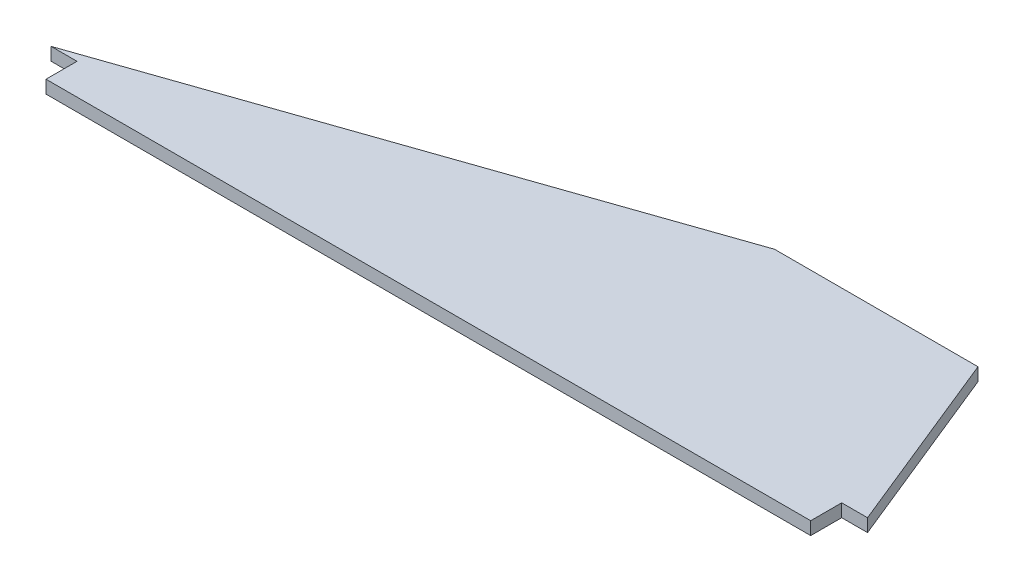
ISO-10303-21;
HEADER;
FILE_DESCRIPTION(('STEP AP214'),'2;1');
FILE_NAME('part.step','',(''),(''),'','','');
FILE_SCHEMA(('AUTOMOTIVE_DESIGN { 1 0 10303 214 1 1 1 1 }'));
ENDSEC;
DATA;
#1=APPLICATION_CONTEXT('core data for automotive mechanical design processes');
#2=APPLICATION_PROTOCOL_DEFINITION('international standard','automotive_design',2000,#1);
#3=PRODUCT_CONTEXT('',#1,'mechanical');
#4=PRODUCT('Part','Part','',(#3));
#5=PRODUCT_RELATED_PRODUCT_CATEGORY('part','',(#4));
#6=PRODUCT_DEFINITION_FORMATION('','',#4);
#7=PRODUCT_DEFINITION_CONTEXT('part definition',#1,'design');
#8=PRODUCT_DEFINITION('design','',#6,#7);
#9=PRODUCT_DEFINITION_SHAPE('','',#8);
#10=(LENGTH_UNIT() NAMED_UNIT(*) SI_UNIT(.MILLI.,.METRE.));
#11=(NAMED_UNIT(*) PLANE_ANGLE_UNIT() SI_UNIT($,.RADIAN.));
#12=(NAMED_UNIT(*) SI_UNIT($,.STERADIAN.) SOLID_ANGLE_UNIT());
#13=UNCERTAINTY_MEASURE_WITH_UNIT(LENGTH_MEASURE(1.E-05),#10,'distance_accuracy_value','');
#14=(GEOMETRIC_REPRESENTATION_CONTEXT(3) GLOBAL_UNCERTAINTY_ASSIGNED_CONTEXT((#13)) GLOBAL_UNIT_ASSIGNED_CONTEXT((#10,
#11,#12)) REPRESENTATION_CONTEXT('',''));
#15=CARTESIAN_POINT('',(0.,0.,0.));
#16=DIRECTION('',(0.,0.,1.));
#17=DIRECTION('',(1.,0.,0.));
#18=AXIS2_PLACEMENT_3D('',#15,#16,#17);
#19=CARTESIAN_POINT('',(6.35,3.175,0.));
#20=DIRECTION('',(1.,0.,0.));
#21=DIRECTION('',(0.,0.,-1.));
#22=AXIS2_PLACEMENT_3D('',#19,#20,#21);
#23=PLANE('',#22);
#24=DIRECTION('',(0.,0.,1.));
#25=VECTOR('',#24,1.);
#26=CARTESIAN_POINT('',(6.35,0.,0.));
#27=LINE('',#26,#25);
#28=CARTESIAN_POINT('',(6.35,0.,0.));
#29=VERTEX_POINT('',#28);
#30=CARTESIAN_POINT('',(6.35,0.,7.62));
#31=VERTEX_POINT('',#30);
#32=EDGE_CURVE('E134',#29,#31,#27,.T.);
#33=ORIENTED_EDGE('',*,*,#32,.T.);
#34=DIRECTION('',(0.,-1.,0.));
#35=VECTOR('',#34,1.);
#36=CARTESIAN_POINT('',(6.35,3.175,7.62));
#37=LINE('',#36,#35);
#38=CARTESIAN_POINT('',(6.35,3.175,7.62));
#39=VERTEX_POINT('',#38);
#40=EDGE_CURVE('E11',#39,#31,#37,.T.);
#41=ORIENTED_EDGE('',*,*,#40,.F.);
#42=DIRECTION('',(0.,0.,1.));
#43=VECTOR('',#42,1.);
#44=CARTESIAN_POINT('',(6.35,3.175,0.));
#45=LINE('',#44,#43);
#46=CARTESIAN_POINT('',(6.35,3.175,0.));
#47=VERTEX_POINT('',#46);
#48=EDGE_CURVE('E148',#47,#39,#45,.T.);
#49=ORIENTED_EDGE('',*,*,#48,.F.);
#50=DIRECTION('',(0.,-1.,0.));
#51=VECTOR('',#50,1.);
#52=CARTESIAN_POINT('',(6.35,3.175,0.));
#53=LINE('',#52,#51);
#54=EDGE_CURVE('E130',#47,#29,#53,.T.);
#55=ORIENTED_EDGE('',*,*,#54,.T.);
#56=EDGE_LOOP('',(#33,#41,#49,#55));
#57=FACE_BOUND('',#56,.T.);
#58=ADVANCED_FACE('F38',(#57),#23,.F.);
#59=CARTESIAN_POINT('',(6.35,3.175,7.62));
#60=DIRECTION('',(0.,0.,-1.));
#61=DIRECTION('',(-1.,0.,0.));
#62=AXIS2_PLACEMENT_3D('',#59,#60,#61);
#63=PLANE('',#62);
#64=DIRECTION('',(1.,0.,0.));
#65=VECTOR('',#64,1.);
#66=CARTESIAN_POINT('',(6.35,0.,7.62));
#67=LINE('',#66,#65);
#68=CARTESIAN_POINT('',(194.31,0.,7.62));
#69=VERTEX_POINT('',#68);
#70=EDGE_CURVE('E137',#31,#69,#67,.T.);
#71=ORIENTED_EDGE('',*,*,#70,.T.);
#72=DIRECTION('',(0.,-1.,0.));
#73=VECTOR('',#72,1.);
#74=CARTESIAN_POINT('',(194.31,3.175,7.62));
#75=LINE('',#74,#73);
#76=CARTESIAN_POINT('',(194.31,3.175,7.62));
#77=VERTEX_POINT('',#76);
#78=EDGE_CURVE('E46',#77,#69,#75,.T.);
#79=ORIENTED_EDGE('',*,*,#78,.F.);
#80=DIRECTION('',(1.,0.,0.));
#81=VECTOR('',#80,1.);
#82=CARTESIAN_POINT('',(6.35,3.175,7.62));
#83=LINE('',#82,#81);
#84=EDGE_CURVE('E97',#39,#77,#83,.T.);
#85=ORIENTED_EDGE('',*,*,#84,.F.);
#86=ORIENTED_EDGE('',*,*,#40,.T.);
#87=EDGE_LOOP('',(#71,#79,#85,#86));
#88=FACE_BOUND('',#87,.T.);
#89=ADVANCED_FACE('F183',(#88),#63,.F.);
#90=CARTESIAN_POINT('',(194.31,3.175,0.));
#91=DIRECTION('',(-1.,0.,0.));
#92=DIRECTION('',(0.,0.,1.));
#93=AXIS2_PLACEMENT_3D('',#90,#91,#92);
#94=PLANE('',#93);
#95=DIRECTION('',(0.,0.,-1.));
#96=VECTOR('',#95,1.);
#97=CARTESIAN_POINT('',(194.31,0.,0.));
#98=LINE('',#97,#96);
#99=CARTESIAN_POINT('',(194.31,0.,0.));
#100=VERTEX_POINT('',#99);
#101=EDGE_CURVE('E139',#69,#100,#98,.T.);
#102=ORIENTED_EDGE('',*,*,#101,.T.);
#103=DIRECTION('',(0.,-1.,0.));
#104=VECTOR('',#103,1.);
#105=CARTESIAN_POINT('',(194.31,3.175,0.));
#106=LINE('',#105,#104);
#107=CARTESIAN_POINT('',(194.31,3.175,0.));
#108=VERTEX_POINT('',#107);
#109=EDGE_CURVE('E155',#108,#100,#106,.T.);
#110=ORIENTED_EDGE('',*,*,#109,.F.);
#111=DIRECTION('',(0.,0.,-1.));
#112=VECTOR('',#111,1.);
#113=CARTESIAN_POINT('',(194.31,3.175,0.));
#114=LINE('',#113,#112);
#115=EDGE_CURVE('E163',#77,#108,#114,.T.);
#116=ORIENTED_EDGE('',*,*,#115,.F.);
#117=ORIENTED_EDGE('',*,*,#78,.T.);
#118=EDGE_LOOP('',(#102,#110,#116,#117));
#119=FACE_BOUND('',#118,.T.);
#120=ADVANCED_FACE('F161',(#119),#94,.F.);
#121=CARTESIAN_POINT('',(194.31,3.175,0.));
#122=DIRECTION('',(0.,0.,-1.));
#123=DIRECTION('',(-1.,0.,0.));
#124=AXIS2_PLACEMENT_3D('',#121,#122,#123);
#125=PLANE('',#124);
#126=DIRECTION('',(1.,0.,0.));
#127=VECTOR('',#126,1.);
#128=CARTESIAN_POINT('',(194.31,0.,0.));
#129=LINE('',#128,#127);
#130=CARTESIAN_POINT('',(200.66,0.,0.));
#131=VERTEX_POINT('',#130);
#132=EDGE_CURVE('E141',#100,#131,#129,.T.);
#133=ORIENTED_EDGE('',*,*,#132,.T.);
#134=DIRECTION('',(0.,-1.,0.));
#135=VECTOR('',#134,1.);
#136=CARTESIAN_POINT('',(200.66,3.175,0.));
#137=LINE('',#136,#135);
#138=CARTESIAN_POINT('',(200.66,3.175,0.));
#139=VERTEX_POINT('',#138);
#140=EDGE_CURVE('E152',#139,#131,#137,.T.);
#141=ORIENTED_EDGE('',*,*,#140,.F.);
#142=DIRECTION('',(1.,0.,0.));
#143=VECTOR('',#142,1.);
#144=CARTESIAN_POINT('',(194.31,3.175,0.));
#145=LINE('',#144,#143);
#146=EDGE_CURVE('E175',#108,#139,#145,.T.);
#147=ORIENTED_EDGE('',*,*,#146,.F.);
#148=ORIENTED_EDGE('',*,*,#109,.T.);
#149=EDGE_LOOP('',(#133,#141,#147,#148));
#150=FACE_BOUND('',#149,.T.);
#151=ADVANCED_FACE('F171',(#150),#125,.F.);
#152=CARTESIAN_POINT('',(182.0926,3.175,-45.72));
#153=DIRECTION('',(-0.926511442099165,0.,0.37626659120805));
#154=DIRECTION('',(0.37626659120805,0.,0.926511442099165));
#155=AXIS2_PLACEMENT_3D('',#152,#153,#154);
#156=PLANE('',#155);
#157=DIRECTION('',(-0.37626659120805,0.,-0.926511442099165));
#158=VECTOR('',#157,1.);
#159=CARTESIAN_POINT('',(182.0926,0.,-45.72));
#160=LINE('',#159,#158);
#161=CARTESIAN_POINT('',(182.0926,0.,-45.72));
#162=VERTEX_POINT('',#161);
#163=EDGE_CURVE('E143',#131,#162,#160,.T.);
#164=ORIENTED_EDGE('',*,*,#163,.T.);
#165=DIRECTION('',(0.,-1.,0.));
#166=VECTOR('',#165,1.);
#167=CARTESIAN_POINT('',(182.0926,3.175,-45.72));
#168=LINE('',#167,#166);
#169=CARTESIAN_POINT('',(182.0926,3.175,-45.72));
#170=VERTEX_POINT('',#169);
#171=EDGE_CURVE('E125',#170,#162,#168,.T.);
#172=ORIENTED_EDGE('',*,*,#171,.F.);
#173=DIRECTION('',(-0.37626659120805,0.,-0.926511442099165));
#174=VECTOR('',#173,1.);
#175=CARTESIAN_POINT('',(182.0926,3.175,-45.72));
#176=LINE('',#175,#174);
#177=EDGE_CURVE('E116',#139,#170,#176,.T.);
#178=ORIENTED_EDGE('',*,*,#177,.F.);
#179=ORIENTED_EDGE('',*,*,#140,.T.);
#180=EDGE_LOOP('',(#164,#172,#178,#179));
#181=FACE_BOUND('',#180,.T.);
#182=ADVANCED_FACE('F174',(#181),#156,.F.);
#183=CARTESIAN_POINT('',(132.08,3.175,-45.72));
#184=DIRECTION('',(0.,0.,1.));
#185=DIRECTION('',(1.,0.,0.));
#186=AXIS2_PLACEMENT_3D('',#183,#184,#185);
#187=PLANE('',#186);
#188=DIRECTION('',(-1.,0.,0.));
#189=VECTOR('',#188,1.);
#190=CARTESIAN_POINT('',(132.08,0.,-45.72));
#191=LINE('',#190,#189);
#192=CARTESIAN_POINT('',(132.08,0.,-45.72));
#193=VERTEX_POINT('',#192);
#194=EDGE_CURVE('E124',#162,#193,#191,.T.);
#195=ORIENTED_EDGE('',*,*,#194,.T.);
#196=DIRECTION('',(0.,-1.,0.));
#197=VECTOR('',#196,1.);
#198=CARTESIAN_POINT('',(132.08,3.175,-45.72));
#199=LINE('',#198,#197);
#200=CARTESIAN_POINT('',(132.08,3.175,-45.72));
#201=VERTEX_POINT('',#200);
#202=EDGE_CURVE('E121',#201,#193,#199,.T.);
#203=ORIENTED_EDGE('',*,*,#202,.F.);
#204=DIRECTION('',(-1.,0.,0.));
#205=VECTOR('',#204,1.);
#206=CARTESIAN_POINT('',(132.08,3.175,-45.72));
#207=LINE('',#206,#205);
#208=EDGE_CURVE('E110',#170,#201,#207,.T.);
#209=ORIENTED_EDGE('',*,*,#208,.F.);
#210=ORIENTED_EDGE('',*,*,#171,.T.);
#211=EDGE_LOOP('',(#195,#203,#209,#210));
#212=FACE_BOUND('',#211,.T.);
#213=ADVANCED_FACE('F122',(#212),#187,.F.);
#214=CARTESIAN_POINT('',(0.,3.175,0.));
#215=DIRECTION('',(0.327110563883166,0.,0.944986073440258));
#216=DIRECTION('',(0.944986073440258,0.,-0.327110563883166));
#217=AXIS2_PLACEMENT_3D('',#214,#215,#216);
#218=PLANE('',#217);
#219=DIRECTION('',(-0.944986073440258,0.,0.327110563883166));
#220=VECTOR('',#219,1.);
#221=CARTESIAN_POINT('',(0.,0.,0.));
#222=LINE('',#221,#220);
#223=CARTESIAN_POINT('',(0.,0.,0.));
#224=VERTEX_POINT('',#223);
#225=EDGE_CURVE('E83',#193,#224,#222,.T.);
#226=ORIENTED_EDGE('',*,*,#225,.T.);
#227=DIRECTION('',(0.,-1.,0.));
#228=VECTOR('',#227,1.);
#229=CARTESIAN_POINT('',(0.,3.175,0.));
#230=LINE('',#229,#228);
#231=CARTESIAN_POINT('',(0.,3.175,0.));
#232=VERTEX_POINT('',#231);
#233=EDGE_CURVE('E126',#232,#224,#230,.T.);
#234=ORIENTED_EDGE('',*,*,#233,.F.);
#235=DIRECTION('',(-0.944986073440258,0.,0.327110563883166));
#236=VECTOR('',#235,1.);
#237=CARTESIAN_POINT('',(0.,3.175,0.));
#238=LINE('',#237,#236);
#239=EDGE_CURVE('E114',#201,#232,#238,.T.);
#240=ORIENTED_EDGE('',*,*,#239,.F.);
#241=ORIENTED_EDGE('',*,*,#202,.T.);
#242=EDGE_LOOP('',(#226,#234,#240,#241));
#243=FACE_BOUND('',#242,.T.);
#244=ADVANCED_FACE('F128',(#243),#218,.F.);
#245=CARTESIAN_POINT('',(0.,3.175,0.));
#246=DIRECTION('',(0.,0.,-1.));
#247=DIRECTION('',(-1.,0.,0.));
#248=AXIS2_PLACEMENT_3D('',#245,#246,#247);
#249=PLANE('',#248);
#250=DIRECTION('',(1.,0.,0.));
#251=VECTOR('',#250,1.);
#252=CARTESIAN_POINT('',(0.,0.,0.));
#253=LINE('',#252,#251);
#254=EDGE_CURVE('E89',#224,#29,#253,.T.);
#255=ORIENTED_EDGE('',*,*,#254,.T.);
#256=ORIENTED_EDGE('',*,*,#54,.F.);
#257=DIRECTION('',(1.,0.,0.));
#258=VECTOR('',#257,1.);
#259=CARTESIAN_POINT('',(0.,3.175,0.));
#260=LINE('',#259,#258);
#261=EDGE_CURVE('E54',#232,#47,#260,.T.);
#262=ORIENTED_EDGE('',*,*,#261,.F.);
#263=ORIENTED_EDGE('',*,*,#233,.T.);
#264=EDGE_LOOP('',(#255,#256,#262,#263));
#265=FACE_BOUND('',#264,.T.);
#266=ADVANCED_FACE('F199',(#265),#249,.F.);
#267=CARTESIAN_POINT('',(0.,3.175,0.));
#268=DIRECTION('',(0.,1.,0.));
#269=DIRECTION('',(0.,0.,1.));
#270=AXIS2_PLACEMENT_3D('',#267,#268,#269);
#271=PLANE('',#270);
#272=ORIENTED_EDGE('',*,*,#48,.T.);
#273=ORIENTED_EDGE('',*,*,#84,.T.);
#274=ORIENTED_EDGE('',*,*,#115,.T.);
#275=ORIENTED_EDGE('',*,*,#146,.T.);
#276=ORIENTED_EDGE('',*,*,#177,.T.);
#277=ORIENTED_EDGE('',*,*,#208,.T.);
#278=ORIENTED_EDGE('',*,*,#239,.T.);
#279=ORIENTED_EDGE('',*,*,#261,.T.);
#280=EDGE_LOOP('',(#272,#273,#274,#275,#276,#277,#278,#279));
#281=FACE_BOUND('',#280,.T.);
#282=ADVANCED_FACE('F112',(#281),#271,.T.);
#283=CARTESIAN_POINT('',(0.,0.,0.));
#284=DIRECTION('',(0.,1.,0.));
#285=DIRECTION('',(0.,0.,1.));
#286=AXIS2_PLACEMENT_3D('',#283,#284,#285);
#287=PLANE('',#286);
#288=ORIENTED_EDGE('',*,*,#32,.F.);
#289=ORIENTED_EDGE('',*,*,#254,.F.);
#290=ORIENTED_EDGE('',*,*,#225,.F.);
#291=ORIENTED_EDGE('',*,*,#194,.F.);
#292=ORIENTED_EDGE('',*,*,#163,.F.);
#293=ORIENTED_EDGE('',*,*,#132,.F.);
#294=ORIENTED_EDGE('',*,*,#101,.F.);
#295=ORIENTED_EDGE('',*,*,#70,.F.);
#296=EDGE_LOOP('',(#288,#289,#290,#291,#292,#293,#294,#295));
#297=FACE_BOUND('',#296,.T.);
#298=ADVANCED_FACE('F167',(#297),#287,.F.);
#299=CLOSED_SHELL('',(#58,#89,#120,#151,#182,#213,#244,#266,#282,#298));
#300=MANIFOLD_SOLID_BREP('B2',#299);
#301=ADVANCED_BREP_SHAPE_REPRESENTATION('',(#18,#300),#14);
#302=SHAPE_DEFINITION_REPRESENTATION(#9,#301);
ENDSEC;
END-ISO-10303-21;
